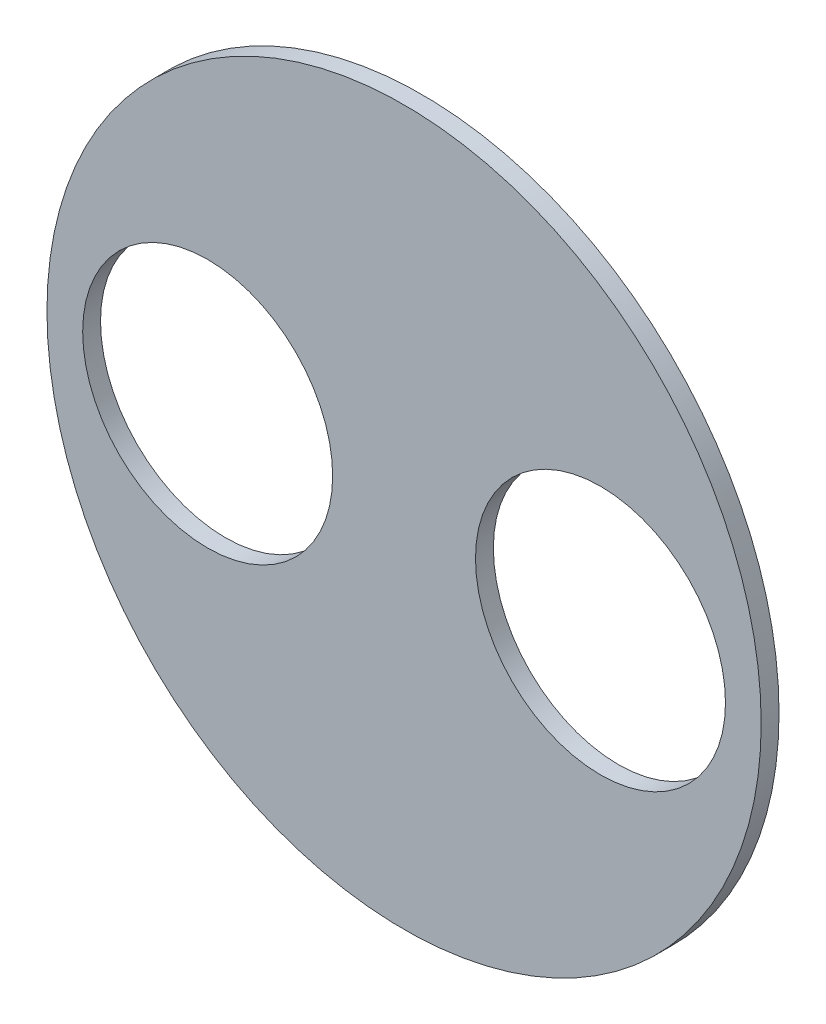
ISO-10303-21;
HEADER;
FILE_DESCRIPTION(('STEP AP214'),'2;1');
FILE_NAME('part.step','',(''),(''),'','','');
FILE_SCHEMA(('AUTOMOTIVE_DESIGN { 1 0 10303 214 1 1 1 1 }'));
ENDSEC;
DATA;
#1=APPLICATION_CONTEXT('core data for automotive mechanical design processes');
#2=APPLICATION_PROTOCOL_DEFINITION('international standard','automotive_design',2000,#1);
#3=PRODUCT_CONTEXT('',#1,'mechanical');
#4=PRODUCT('Part','Part','',(#3));
#5=PRODUCT_RELATED_PRODUCT_CATEGORY('part','',(#4));
#6=PRODUCT_DEFINITION_FORMATION('','',#4);
#7=PRODUCT_DEFINITION_CONTEXT('part definition',#1,'design');
#8=PRODUCT_DEFINITION('design','',#6,#7);
#9=PRODUCT_DEFINITION_SHAPE('','',#8);
#10=(LENGTH_UNIT() NAMED_UNIT(*) SI_UNIT(.MILLI.,.METRE.));
#11=(NAMED_UNIT(*) PLANE_ANGLE_UNIT() SI_UNIT($,.RADIAN.));
#12=(NAMED_UNIT(*) SI_UNIT($,.STERADIAN.) SOLID_ANGLE_UNIT());
#13=UNCERTAINTY_MEASURE_WITH_UNIT(LENGTH_MEASURE(1.E-05),#10,'distance_accuracy_value','');
#14=(GEOMETRIC_REPRESENTATION_CONTEXT(3) GLOBAL_UNCERTAINTY_ASSIGNED_CONTEXT((#13)) GLOBAL_UNIT_ASSIGNED_CONTEXT((#10,
#11,#12)) REPRESENTATION_CONTEXT('',''));
#15=CARTESIAN_POINT('',(0.,0.,0.));
#16=DIRECTION('',(0.,0.,1.));
#17=DIRECTION('',(1.,0.,0.));
#18=AXIS2_PLACEMENT_3D('',#15,#16,#17);
#19=CARTESIAN_POINT('',(0.,0.,3.175));
#20=DIRECTION('',(0.,0.,1.));
#21=DIRECTION('',(1.,0.,0.));
#22=AXIS2_PLACEMENT_3D('',#19,#20,#21);
#23=PLANE('',#22);
#24=CARTESIAN_POINT('',(34.925,0.,3.175));
#25=DIRECTION('',(0.,0.,1.));
#26=DIRECTION('',(1.,0.,0.));
#27=AXIS2_PLACEMENT_3D('',#24,#25,#26);
#28=CIRCLE('',#27,22.225);
#29=CARTESIAN_POINT('',(57.15,0.,3.175));
#30=VERTEX_POINT('',#29);
#31=EDGE_CURVE('E42',#30,#30,#28,.T.);
#32=ORIENTED_EDGE('',*,*,#31,.F.);
#33=EDGE_LOOP('',(#32));
#34=FACE_BOUND('',#33,.T.);
#35=CARTESIAN_POINT('',(0.,0.,3.175));
#36=DIRECTION('',(0.,0.,1.));
#37=DIRECTION('',(1.,0.,0.));
#38=AXIS2_PLACEMENT_3D('',#35,#36,#37);
#39=CIRCLE('',#38,63.5);
#40=CARTESIAN_POINT('',(63.5,0.,3.175));
#41=VERTEX_POINT('',#40);
#42=EDGE_CURVE('E10',#41,#41,#39,.T.);
#43=ORIENTED_EDGE('',*,*,#42,.T.);
#44=EDGE_LOOP('',(#43));
#45=FACE_BOUND('',#44,.T.);
#46=CARTESIAN_POINT('',(-34.925,0.,3.175));
#47=DIRECTION('',(0.,0.,1.));
#48=DIRECTION('',(1.,0.,0.));
#49=AXIS2_PLACEMENT_3D('',#46,#47,#48);
#50=CIRCLE('',#49,22.225);
#51=CARTESIAN_POINT('',(-12.7,0.,3.175));
#52=VERTEX_POINT('',#51);
#53=EDGE_CURVE('E47',#52,#52,#50,.T.);
#54=ORIENTED_EDGE('',*,*,#53,.F.);
#55=EDGE_LOOP('',(#54));
#56=FACE_BOUND('',#55,.T.);
#57=ADVANCED_FACE('F31',(#34,#45,#56),#23,.T.);
#58=CARTESIAN_POINT('',(0.,0.,0.));
#59=DIRECTION('',(0.,0.,1.));
#60=DIRECTION('',(1.,0.,0.));
#61=AXIS2_PLACEMENT_3D('',#58,#59,#60);
#62=PLANE('',#61);
#63=CARTESIAN_POINT('',(34.925,0.,0.));
#64=DIRECTION('',(0.,0.,1.));
#65=DIRECTION('',(1.,0.,0.));
#66=AXIS2_PLACEMENT_3D('',#63,#64,#65);
#67=CIRCLE('',#66,22.225);
#68=CARTESIAN_POINT('',(57.15,0.,0.));
#69=VERTEX_POINT('',#68);
#70=EDGE_CURVE('E44',#69,#69,#67,.T.);
#71=ORIENTED_EDGE('',*,*,#70,.T.);
#72=EDGE_LOOP('',(#71));
#73=FACE_BOUND('',#72,.T.);
#74=CARTESIAN_POINT('',(0.,0.,0.));
#75=DIRECTION('',(0.,0.,1.));
#76=DIRECTION('',(1.,0.,0.));
#77=AXIS2_PLACEMENT_3D('',#74,#75,#76);
#78=CIRCLE('',#77,63.5);
#79=CARTESIAN_POINT('',(63.5,0.,0.));
#80=VERTEX_POINT('',#79);
#81=EDGE_CURVE('E35',#80,#80,#78,.T.);
#82=ORIENTED_EDGE('',*,*,#81,.F.);
#83=EDGE_LOOP('',(#82));
#84=FACE_BOUND('',#83,.T.);
#85=CARTESIAN_POINT('',(-34.925,0.,0.));
#86=DIRECTION('',(0.,0.,1.));
#87=DIRECTION('',(1.,0.,0.));
#88=AXIS2_PLACEMENT_3D('',#85,#86,#87);
#89=CIRCLE('',#88,22.225);
#90=CARTESIAN_POINT('',(-12.7,0.,0.));
#91=VERTEX_POINT('',#90);
#92=EDGE_CURVE('E50',#91,#91,#89,.T.);
#93=ORIENTED_EDGE('',*,*,#92,.T.);
#94=EDGE_LOOP('',(#93));
#95=FACE_BOUND('',#94,.T.);
#96=ADVANCED_FACE('F60',(#73,#84,#95),#62,.F.);
#97=CARTESIAN_POINT('',(0.,0.,3.175));
#98=DIRECTION('',(0.,0.,-1.));
#99=DIRECTION('',(-1.,0.,0.));
#100=AXIS2_PLACEMENT_3D('',#97,#98,#99);
#101=CYLINDRICAL_SURFACE('',#100,63.5);
#102=ORIENTED_EDGE('',*,*,#42,.F.);
#103=EDGE_LOOP('',(#102));
#104=FACE_BOUND('',#103,.T.);
#105=ORIENTED_EDGE('',*,*,#81,.T.);
#106=EDGE_LOOP('',(#105));
#107=FACE_BOUND('',#106,.T.);
#108=ADVANCED_FACE('F33',(#104,#107),#101,.T.);
#109=CARTESIAN_POINT('',(34.925,0.,3.175));
#110=DIRECTION('',(0.,0.,-1.));
#111=DIRECTION('',(-1.,0.,0.));
#112=AXIS2_PLACEMENT_3D('',#109,#110,#111);
#113=CYLINDRICAL_SURFACE('',#112,22.225);
#114=ORIENTED_EDGE('',*,*,#31,.T.);
#115=EDGE_LOOP('',(#114));
#116=FACE_BOUND('',#115,.T.);
#117=ORIENTED_EDGE('',*,*,#70,.F.);
#118=EDGE_LOOP('',(#117));
#119=FACE_BOUND('',#118,.T.);
#120=ADVANCED_FACE('F69',(#116,#119),#113,.F.);
#121=CARTESIAN_POINT('',(-34.925,0.,3.175));
#122=DIRECTION('',(0.,0.,-1.));
#123=DIRECTION('',(-1.,0.,0.));
#124=AXIS2_PLACEMENT_3D('',#121,#122,#123);
#125=CYLINDRICAL_SURFACE('',#124,22.225);
#126=ORIENTED_EDGE('',*,*,#53,.T.);
#127=EDGE_LOOP('',(#126));
#128=FACE_BOUND('',#127,.T.);
#129=ORIENTED_EDGE('',*,*,#92,.F.);
#130=EDGE_LOOP('',(#129));
#131=FACE_BOUND('',#130,.T.);
#132=ADVANCED_FACE('F56',(#128,#131),#125,.F.);
#133=CLOSED_SHELL('',(#57,#96,#108,#120,#132));
#134=MANIFOLD_SOLID_BREP('B2',#133);
#135=ADVANCED_BREP_SHAPE_REPRESENTATION('',(#18,#134),#14);
#136=SHAPE_DEFINITION_REPRESENTATION(#9,#135);
ENDSEC;
END-ISO-10303-21;
